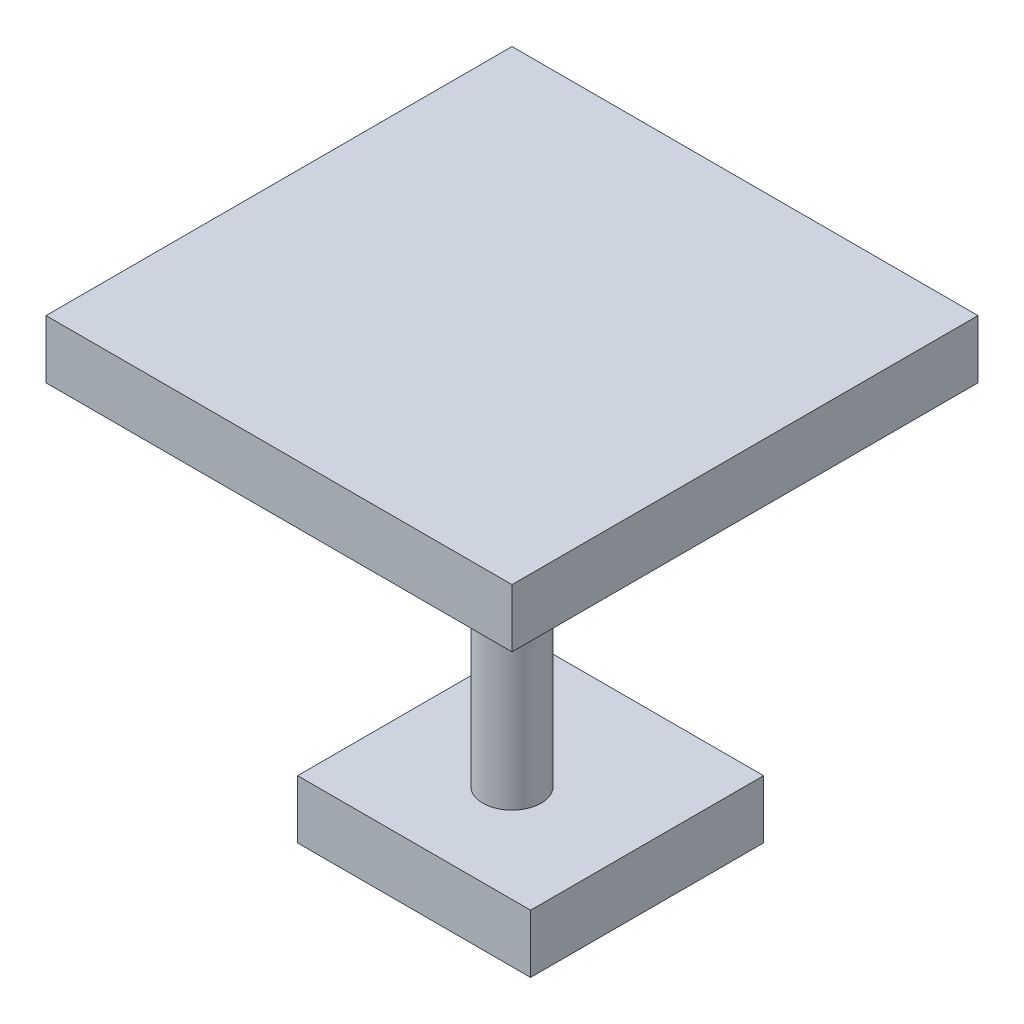
ISO-10303-21;
HEADER;
FILE_DESCRIPTION(('STEP AP214'),'2;1');
FILE_NAME('part.step','',(''),(''),'','','');
FILE_SCHEMA(('AUTOMOTIVE_DESIGN { 1 0 10303 214 1 1 1 1 }'));
ENDSEC;
DATA;
#1=APPLICATION_CONTEXT('core data for automotive mechanical design processes');
#2=APPLICATION_PROTOCOL_DEFINITION('international standard','automotive_design',2000,#1);
#3=PRODUCT_CONTEXT('',#1,'mechanical');
#4=PRODUCT('Part','Part','',(#3));
#5=PRODUCT_RELATED_PRODUCT_CATEGORY('part','',(#4));
#6=PRODUCT_DEFINITION_FORMATION('','',#4);
#7=PRODUCT_DEFINITION_CONTEXT('part definition',#1,'design');
#8=PRODUCT_DEFINITION('design','',#6,#7);
#9=PRODUCT_DEFINITION_SHAPE('','',#8);
#10=(LENGTH_UNIT() NAMED_UNIT(*) SI_UNIT(.MILLI.,.METRE.));
#11=(NAMED_UNIT(*) PLANE_ANGLE_UNIT() SI_UNIT($,.RADIAN.));
#12=(NAMED_UNIT(*) SI_UNIT($,.STERADIAN.) SOLID_ANGLE_UNIT());
#13=UNCERTAINTY_MEASURE_WITH_UNIT(LENGTH_MEASURE(1.E-05),#10,'distance_accuracy_value','');
#14=(GEOMETRIC_REPRESENTATION_CONTEXT(3) GLOBAL_UNCERTAINTY_ASSIGNED_CONTEXT((#13)) GLOBAL_UNIT_ASSIGNED_CONTEXT((#10,
#11,#12)) REPRESENTATION_CONTEXT('',''));
#15=CARTESIAN_POINT('',(0.,0.,0.));
#16=DIRECTION('',(0.,0.,1.));
#17=DIRECTION('',(1.,0.,0.));
#18=AXIS2_PLACEMENT_3D('',#15,#16,#17);
#19=CARTESIAN_POINT('',(10.,30.,10.));
#20=DIRECTION('',(0.,-1.,0.));
#21=DIRECTION('',(0.,0.,-1.));
#22=AXIS2_PLACEMENT_3D('',#19,#20,#21);
#23=CYLINDRICAL_SURFACE('',#22,2.5);
#24=CARTESIAN_POINT('',(10.,30.,10.));
#25=DIRECTION('',(0.,1.,0.));
#26=DIRECTION('',(0.,0.,1.));
#27=AXIS2_PLACEMENT_3D('',#24,#25,#26);
#28=CIRCLE('',#27,2.5);
#29=CARTESIAN_POINT('',(10.,30.,12.5));
#30=VERTEX_POINT('',#29);
#31=EDGE_CURVE('E11',#30,#30,#28,.T.);
#32=ORIENTED_EDGE('',*,*,#31,.F.);
#33=EDGE_LOOP('',(#32));
#34=FACE_BOUND('',#33,.T.);
#35=CARTESIAN_POINT('',(10.,0.,10.));
#36=DIRECTION('',(0.,1.,0.));
#37=DIRECTION('',(0.,0.,1.));
#38=AXIS2_PLACEMENT_3D('',#35,#36,#37);
#39=CIRCLE('',#38,2.5);
#40=CARTESIAN_POINT('',(10.,0.,12.5));
#41=VERTEX_POINT('',#40);
#42=EDGE_CURVE('E42',#41,#41,#39,.T.);
#43=ORIENTED_EDGE('',*,*,#42,.T.);
#44=EDGE_LOOP('',(#43));
#45=FACE_BOUND('',#44,.T.);
#46=ADVANCED_FACE('F39',(#34,#45),#23,.T.);
#47=CARTESIAN_POINT('',(30.,35.,-10.));
#48=DIRECTION('',(-1.,0.,0.));
#49=DIRECTION('',(0.,0.,1.));
#50=AXIS2_PLACEMENT_3D('',#47,#48,#49);
#51=PLANE('',#50);
#52=DIRECTION('',(0.,0.,-1.));
#53=VECTOR('',#52,1.);
#54=CARTESIAN_POINT('',(30.,30.,-10.));
#55=LINE('',#54,#53);
#56=CARTESIAN_POINT('',(30.,30.,30.));
#57=VERTEX_POINT('',#56);
#58=CARTESIAN_POINT('',(30.,30.,-10.));
#59=VERTEX_POINT('',#58);
#60=EDGE_CURVE('E148',#57,#59,#55,.T.);
#61=ORIENTED_EDGE('',*,*,#60,.T.);
#62=DIRECTION('',(0.,-1.,0.));
#63=VECTOR('',#62,1.);
#64=CARTESIAN_POINT('',(30.,35.,-10.));
#65=LINE('',#64,#63);
#66=CARTESIAN_POINT('',(30.,35.,-10.));
#67=VERTEX_POINT('',#66);
#68=EDGE_CURVE('E49',#67,#59,#65,.T.);
#69=ORIENTED_EDGE('',*,*,#68,.F.);
#70=DIRECTION('',(0.,0.,-1.));
#71=VECTOR('',#70,1.);
#72=CARTESIAN_POINT('',(30.,35.,-10.));
#73=LINE('',#72,#71);
#74=CARTESIAN_POINT('',(30.,35.,30.));
#75=VERTEX_POINT('',#74);
#76=EDGE_CURVE('E153',#75,#67,#73,.T.);
#77=ORIENTED_EDGE('',*,*,#76,.F.);
#78=DIRECTION('',(0.,-1.,0.));
#79=VECTOR('',#78,1.);
#80=CARTESIAN_POINT('',(30.,35.,30.));
#81=LINE('',#80,#79);
#82=EDGE_CURVE('E163',#75,#57,#81,.T.);
#83=ORIENTED_EDGE('',*,*,#82,.T.);
#84=EDGE_LOOP('',(#61,#69,#77,#83));
#85=FACE_BOUND('',#84,.T.);
#86=ADVANCED_FACE('F188',(#85),#51,.F.);
#87=CARTESIAN_POINT('',(-10.,35.,-10.));
#88=DIRECTION('',(0.,0.,1.));
#89=DIRECTION('',(1.,0.,0.));
#90=AXIS2_PLACEMENT_3D('',#87,#88,#89);
#91=PLANE('',#90);
#92=DIRECTION('',(-1.,0.,0.));
#93=VECTOR('',#92,1.);
#94=CARTESIAN_POINT('',(-10.,30.,-10.));
#95=LINE('',#94,#93);
#96=CARTESIAN_POINT('',(-10.,30.,-10.));
#97=VERTEX_POINT('',#96);
#98=EDGE_CURVE('E167',#59,#97,#95,.T.);
#99=ORIENTED_EDGE('',*,*,#98,.T.);
#100=DIRECTION('',(0.,-1.,0.));
#101=VECTOR('',#100,1.);
#102=CARTESIAN_POINT('',(-10.,35.,-10.));
#103=LINE('',#102,#101);
#104=CARTESIAN_POINT('',(-10.,35.,-10.));
#105=VERTEX_POINT('',#104);
#106=EDGE_CURVE('E179',#105,#97,#103,.T.);
#107=ORIENTED_EDGE('',*,*,#106,.F.);
#108=DIRECTION('',(-1.,0.,0.));
#109=VECTOR('',#108,1.);
#110=CARTESIAN_POINT('',(-10.,35.,-10.));
#111=LINE('',#110,#109);
#112=EDGE_CURVE('E89',#67,#105,#111,.T.);
#113=ORIENTED_EDGE('',*,*,#112,.F.);
#114=ORIENTED_EDGE('',*,*,#68,.T.);
#115=EDGE_LOOP('',(#99,#107,#113,#114));
#116=FACE_BOUND('',#115,.T.);
#117=ADVANCED_FACE('F184',(#116),#91,.F.);
#118=CARTESIAN_POINT('',(-10.,35.,-10.));
#119=DIRECTION('',(1.,0.,0.));
#120=DIRECTION('',(0.,0.,-1.));
#121=AXIS2_PLACEMENT_3D('',#118,#119,#120);
#122=PLANE('',#121);
#123=DIRECTION('',(0.,0.,1.));
#124=VECTOR('',#123,1.);
#125=CARTESIAN_POINT('',(-10.,30.,-10.));
#126=LINE('',#125,#124);
#127=CARTESIAN_POINT('',(-9.99999999999999,30.,30.));
#128=VERTEX_POINT('',#127);
#129=EDGE_CURVE('E75',#97,#128,#126,.T.);
#130=ORIENTED_EDGE('',*,*,#129,.T.);
#131=DIRECTION('',(0.,-1.,0.));
#132=VECTOR('',#131,1.);
#133=CARTESIAN_POINT('',(-9.99999999999999,35.,30.));
#134=LINE('',#133,#132);
#135=CARTESIAN_POINT('',(-9.99999999999999,35.,30.));
#136=VERTEX_POINT('',#135);
#137=EDGE_CURVE('E176',#136,#128,#134,.T.);
#138=ORIENTED_EDGE('',*,*,#137,.F.);
#139=DIRECTION('',(0.,0.,1.));
#140=VECTOR('',#139,1.);
#141=CARTESIAN_POINT('',(-10.,35.,-10.));
#142=LINE('',#141,#140);
#143=EDGE_CURVE('E158',#105,#136,#142,.T.);
#144=ORIENTED_EDGE('',*,*,#143,.F.);
#145=ORIENTED_EDGE('',*,*,#106,.T.);
#146=EDGE_LOOP('',(#130,#138,#144,#145));
#147=FACE_BOUND('',#146,.T.);
#148=ADVANCED_FACE('F299',(#147),#122,.F.);
#149=CARTESIAN_POINT('',(-9.99999999999999,35.,30.));
#150=DIRECTION('',(0.,0.,-1.));
#151=DIRECTION('',(-1.,0.,0.));
#152=AXIS2_PLACEMENT_3D('',#149,#150,#151);
#153=PLANE('',#152);
#154=DIRECTION('',(1.,0.,0.));
#155=VECTOR('',#154,1.);
#156=CARTESIAN_POINT('',(-9.99999999999999,30.,30.));
#157=LINE('',#156,#155);
#158=EDGE_CURVE('E81',#128,#57,#157,.T.);
#159=ORIENTED_EDGE('',*,*,#158,.T.);
#160=ORIENTED_EDGE('',*,*,#82,.F.);
#161=DIRECTION('',(1.,0.,0.));
#162=VECTOR('',#161,1.);
#163=CARTESIAN_POINT('',(-9.99999999999999,35.,30.));
#164=LINE('',#163,#162);
#165=EDGE_CURVE('E57',#136,#75,#164,.T.);
#166=ORIENTED_EDGE('',*,*,#165,.F.);
#167=ORIENTED_EDGE('',*,*,#137,.T.);
#168=EDGE_LOOP('',(#159,#160,#166,#167));
#169=FACE_BOUND('',#168,.T.);
#170=ADVANCED_FACE('F200',(#169),#153,.F.);
#171=CARTESIAN_POINT('',(0.,35.,0.));
#172=DIRECTION('',(0.,1.,0.));
#173=DIRECTION('',(0.,0.,1.));
#174=AXIS2_PLACEMENT_3D('',#171,#172,#173);
#175=PLANE('',#174);
#176=ORIENTED_EDGE('',*,*,#76,.T.);
#177=ORIENTED_EDGE('',*,*,#112,.T.);
#178=ORIENTED_EDGE('',*,*,#143,.T.);
#179=ORIENTED_EDGE('',*,*,#165,.T.);
#180=EDGE_LOOP('',(#176,#177,#178,#179));
#181=FACE_BOUND('',#180,.T.);
#182=ADVANCED_FACE('F192',(#181),#175,.T.);
#183=CARTESIAN_POINT('',(0.,30.,0.));
#184=DIRECTION('',(0.,1.,0.));
#185=DIRECTION('',(0.,0.,1.));
#186=AXIS2_PLACEMENT_3D('',#183,#184,#185);
#187=PLANE('',#186);
#188=ORIENTED_EDGE('',*,*,#31,.T.);
#189=EDGE_LOOP('',(#188));
#190=FACE_BOUND('',#189,.T.);
#191=ORIENTED_EDGE('',*,*,#60,.F.);
#192=ORIENTED_EDGE('',*,*,#158,.F.);
#193=ORIENTED_EDGE('',*,*,#129,.F.);
#194=ORIENTED_EDGE('',*,*,#98,.F.);
#195=EDGE_LOOP('',(#191,#192,#193,#194));
#196=FACE_BOUND('',#195,.T.);
#197=ADVANCED_FACE('F190',(#190,#196),#187,.F.);
#198=CARTESIAN_POINT('',(0.,-5.,18.4051437142085));
#199=DIRECTION('',(1.,0.,0.));
#200=DIRECTION('',(0.,0.,-1.));
#201=AXIS2_PLACEMENT_3D('',#198,#199,#200);
#202=PLANE('',#201);
#203=DIRECTION('',(0.,0.,-1.));
#204=VECTOR('',#203,1.);
#205=CARTESIAN_POINT('',(0.,0.,18.4051437142085));
#206=LINE('',#205,#204);
#207=CARTESIAN_POINT('',(0.,0.,18.4051437142085));
#208=VERTEX_POINT('',#207);
#209=CARTESIAN_POINT('',(0.,0.,-1.59485628579148));
#210=VERTEX_POINT('',#209);
#211=EDGE_CURVE('E142',#208,#210,#206,.T.);
#212=ORIENTED_EDGE('',*,*,#211,.T.);
#213=DIRECTION('',(0.,1.,0.));
#214=VECTOR('',#213,1.);
#215=CARTESIAN_POINT('',(0.,-5.,-1.59485628579148));
#216=LINE('',#215,#214);
#217=CARTESIAN_POINT('',(0.,-5.,-1.59485628579148));
#218=VERTEX_POINT('',#217);
#219=EDGE_CURVE('E120',#218,#210,#216,.T.);
#220=ORIENTED_EDGE('',*,*,#219,.F.);
#221=DIRECTION('',(0.,0.,-1.));
#222=VECTOR('',#221,1.);
#223=CARTESIAN_POINT('',(0.,-5.,18.4051437142085));
#224=LINE('',#223,#222);
#225=CARTESIAN_POINT('',(0.,-5.,18.4051437142085));
#226=VERTEX_POINT('',#225);
#227=EDGE_CURVE('E128',#226,#218,#224,.T.);
#228=ORIENTED_EDGE('',*,*,#227,.F.);
#229=DIRECTION('',(0.,1.,0.));
#230=VECTOR('',#229,1.);
#231=CARTESIAN_POINT('',(0.,-5.,18.4051437142085));
#232=LINE('',#231,#230);
#233=EDGE_CURVE('E231',#226,#208,#232,.T.);
#234=ORIENTED_EDGE('',*,*,#233,.T.);
#235=EDGE_LOOP('',(#212,#220,#228,#234));
#236=FACE_BOUND('',#235,.T.);
#237=ADVANCED_FACE('F140',(#236),#202,.F.);
#238=CARTESIAN_POINT('',(20.,-5.,-1.59485628579148));
#239=DIRECTION('',(0.,0.,1.));
#240=DIRECTION('',(1.,0.,0.));
#241=AXIS2_PLACEMENT_3D('',#238,#239,#240);
#242=PLANE('',#241);
#243=DIRECTION('',(1.,0.,0.));
#244=VECTOR('',#243,1.);
#245=CARTESIAN_POINT('',(20.,0.,-1.59485628579148));
#246=LINE('',#245,#244);
#247=CARTESIAN_POINT('',(20.,0.,-1.59485628579148));
#248=VERTEX_POINT('',#247);
#249=EDGE_CURVE('E218',#210,#248,#246,.T.);
#250=ORIENTED_EDGE('',*,*,#249,.T.);
#251=DIRECTION('',(0.,1.,0.));
#252=VECTOR('',#251,1.);
#253=CARTESIAN_POINT('',(20.,-5.,-1.59485628579148));
#254=LINE('',#253,#252);
#255=CARTESIAN_POINT('',(20.,-5.,-1.59485628579148));
#256=VERTEX_POINT('',#255);
#257=EDGE_CURVE('E123',#256,#248,#254,.T.);
#258=ORIENTED_EDGE('',*,*,#257,.F.);
#259=DIRECTION('',(1.,0.,0.));
#260=VECTOR('',#259,1.);
#261=CARTESIAN_POINT('',(20.,-5.,-1.59485628579148));
#262=LINE('',#261,#260);
#263=EDGE_CURVE('E116',#218,#256,#262,.T.);
#264=ORIENTED_EDGE('',*,*,#263,.F.);
#265=ORIENTED_EDGE('',*,*,#219,.T.);
#266=EDGE_LOOP('',(#250,#258,#264,#265));
#267=FACE_BOUND('',#266,.T.);
#268=ADVANCED_FACE('F118',(#267),#242,.F.);
#269=CARTESIAN_POINT('',(20.,-5.,18.4051437142085));
#270=DIRECTION('',(-1.,0.,0.));
#271=DIRECTION('',(0.,0.,1.));
#272=AXIS2_PLACEMENT_3D('',#269,#270,#271);
#273=PLANE('',#272);
#274=DIRECTION('',(0.,0.,1.));
#275=VECTOR('',#274,1.);
#276=CARTESIAN_POINT('',(20.,0.,18.4051437142085));
#277=LINE('',#276,#275);
#278=CARTESIAN_POINT('',(20.,0.,18.4051437142085));
#279=VERTEX_POINT('',#278);
#280=EDGE_CURVE('E222',#248,#279,#277,.T.);
#281=ORIENTED_EDGE('',*,*,#280,.T.);
#282=DIRECTION('',(0.,1.,0.));
#283=VECTOR('',#282,1.);
#284=CARTESIAN_POINT('',(20.,-5.,18.4051437142085));
#285=LINE('',#284,#283);
#286=CARTESIAN_POINT('',(20.,-5.,18.4051437142085));
#287=VERTEX_POINT('',#286);
#288=EDGE_CURVE('E149',#287,#279,#285,.T.);
#289=ORIENTED_EDGE('',*,*,#288,.F.);
#290=DIRECTION('',(0.,0.,1.));
#291=VECTOR('',#290,1.);
#292=CARTESIAN_POINT('',(20.,-5.,18.4051437142085));
#293=LINE('',#292,#291);
#294=EDGE_CURVE('E127',#256,#287,#293,.T.);
#295=ORIENTED_EDGE('',*,*,#294,.F.);
#296=ORIENTED_EDGE('',*,*,#257,.T.);
#297=EDGE_LOOP('',(#281,#289,#295,#296));
#298=FACE_BOUND('',#297,.T.);
#299=ADVANCED_FACE('F239',(#298),#273,.F.);
#300=CARTESIAN_POINT('',(20.,-5.,18.4051437142085));
#301=DIRECTION('',(0.,0.,-1.));
#302=DIRECTION('',(-1.,0.,0.));
#303=AXIS2_PLACEMENT_3D('',#300,#301,#302);
#304=PLANE('',#303);
#305=DIRECTION('',(-1.,0.,0.));
#306=VECTOR('',#305,1.);
#307=CARTESIAN_POINT('',(20.,0.,18.4051437142085));
#308=LINE('',#307,#306);
#309=EDGE_CURVE('E138',#279,#208,#308,.T.);
#310=ORIENTED_EDGE('',*,*,#309,.T.);
#311=ORIENTED_EDGE('',*,*,#233,.F.);
#312=DIRECTION('',(-1.,0.,0.));
#313=VECTOR('',#312,1.);
#314=CARTESIAN_POINT('',(20.,-5.,18.4051437142085));
#315=LINE('',#314,#313);
#316=EDGE_CURVE('E133',#287,#226,#315,.T.);
#317=ORIENTED_EDGE('',*,*,#316,.F.);
#318=ORIENTED_EDGE('',*,*,#288,.T.);
#319=EDGE_LOOP('',(#310,#311,#317,#318));
#320=FACE_BOUND('',#319,.T.);
#321=ADVANCED_FACE('F237',(#320),#304,.F.);
#322=CARTESIAN_POINT('',(0.,-5.,0.));
#323=DIRECTION('',(0.,1.,0.));
#324=DIRECTION('',(0.,0.,1.));
#325=AXIS2_PLACEMENT_3D('',#322,#323,#324);
#326=PLANE('',#325);
#327=ORIENTED_EDGE('',*,*,#227,.T.);
#328=ORIENTED_EDGE('',*,*,#263,.T.);
#329=ORIENTED_EDGE('',*,*,#294,.T.);
#330=ORIENTED_EDGE('',*,*,#316,.T.);
#331=EDGE_LOOP('',(#327,#328,#329,#330));
#332=FACE_BOUND('',#331,.T.);
#333=ADVANCED_FACE('F131',(#332),#326,.F.);
#334=CARTESIAN_POINT('',(0.,0.,0.));
#335=DIRECTION('',(0.,1.,0.));
#336=DIRECTION('',(0.,0.,1.));
#337=AXIS2_PLACEMENT_3D('',#334,#335,#336);
#338=PLANE('',#337);
#339=ORIENTED_EDGE('',*,*,#42,.F.);
#340=EDGE_LOOP('',(#339));
#341=FACE_BOUND('',#340,.T.);
#342=ORIENTED_EDGE('',*,*,#211,.F.);
#343=ORIENTED_EDGE('',*,*,#309,.F.);
#344=ORIENTED_EDGE('',*,*,#280,.F.);
#345=ORIENTED_EDGE('',*,*,#249,.F.);
#346=EDGE_LOOP('',(#342,#343,#344,#345));
#347=FACE_BOUND('',#346,.T.);
#348=ADVANCED_FACE('F212',(#341,#347),#338,.T.);
#349=CLOSED_SHELL('',(#46,#86,#117,#148,#170,#182,#197,#237,#268,#299,#321,#333,#348));
#350=MANIFOLD_SOLID_BREP('B2',#349);
#351=ADVANCED_BREP_SHAPE_REPRESENTATION('',(#18,#350),#14);
#352=SHAPE_DEFINITION_REPRESENTATION(#9,#351);
ENDSEC;
END-ISO-10303-21;
